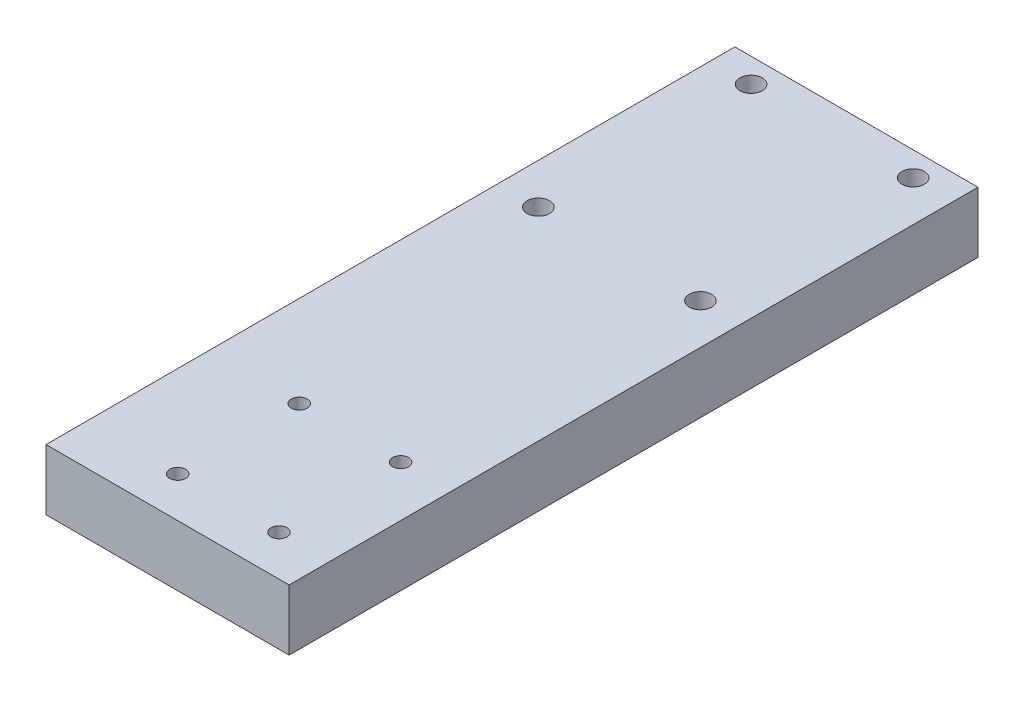
ISO-10303-21;
HEADER;
FILE_DESCRIPTION(('STEP AP214'),'2;1');
FILE_NAME('part.step','',(''),(''),'','','');
FILE_SCHEMA(('AUTOMOTIVE_DESIGN { 1 0 10303 214 1 1 1 1 }'));
ENDSEC;
DATA;
#1=APPLICATION_CONTEXT('core data for automotive mechanical design processes');
#2=APPLICATION_PROTOCOL_DEFINITION('international standard','automotive_design',2000,#1);
#3=PRODUCT_CONTEXT('',#1,'mechanical');
#4=PRODUCT('Part','Part','',(#3));
#5=PRODUCT_RELATED_PRODUCT_CATEGORY('part','',(#4));
#6=PRODUCT_DEFINITION_FORMATION('','',#4);
#7=PRODUCT_DEFINITION_CONTEXT('part definition',#1,'design');
#8=PRODUCT_DEFINITION('design','',#6,#7);
#9=PRODUCT_DEFINITION_SHAPE('','',#8);
#10=(LENGTH_UNIT() NAMED_UNIT(*) SI_UNIT(.MILLI.,.METRE.));
#11=(NAMED_UNIT(*) PLANE_ANGLE_UNIT() SI_UNIT($,.RADIAN.));
#12=(NAMED_UNIT(*) SI_UNIT($,.STERADIAN.) SOLID_ANGLE_UNIT());
#13=UNCERTAINTY_MEASURE_WITH_UNIT(LENGTH_MEASURE(1.E-05),#10,'distance_accuracy_value','');
#14=(GEOMETRIC_REPRESENTATION_CONTEXT(3) GLOBAL_UNCERTAINTY_ASSIGNED_CONTEXT((#13)) GLOBAL_UNIT_ASSIGNED_CONTEXT((#10,
#11,#12)) REPRESENTATION_CONTEXT('',''));
#15=CARTESIAN_POINT('',(0.,0.,0.));
#16=DIRECTION('',(0.,0.,1.));
#17=DIRECTION('',(1.,0.,0.));
#18=AXIS2_PLACEMENT_3D('',#15,#16,#17);
#19=CARTESIAN_POINT('',(0.,0.,215.9));
#20=DIRECTION('',(1.,0.,0.));
#21=DIRECTION('',(0.,0.,-1.));
#22=AXIS2_PLACEMENT_3D('',#19,#20,#21);
#23=PLANE('',#22);
#24=DIRECTION('',(0.,-1.,0.));
#25=VECTOR('',#24,1.);
#26=CARTESIAN_POINT('',(0.,0.,0.));
#27=LINE('',#26,#25);
#28=CARTESIAN_POINT('',(0.,19.05,0.));
#29=VERTEX_POINT('',#28);
#30=CARTESIAN_POINT('',(0.,0.,0.));
#31=VERTEX_POINT('',#30);
#32=EDGE_CURVE('E106',#29,#31,#27,.T.);
#33=ORIENTED_EDGE('',*,*,#32,.T.);
#34=DIRECTION('',(0.,0.,-1.));
#35=VECTOR('',#34,1.);
#36=CARTESIAN_POINT('',(0.,0.,215.9));
#37=LINE('',#36,#35);
#38=CARTESIAN_POINT('',(0.,0.,215.9));
#39=VERTEX_POINT('',#38);
#40=EDGE_CURVE('E11',#39,#31,#37,.T.);
#41=ORIENTED_EDGE('',*,*,#40,.F.);
#42=DIRECTION('',(0.,-1.,0.));
#43=VECTOR('',#42,1.);
#44=CARTESIAN_POINT('',(0.,0.,215.9));
#45=LINE('',#44,#43);
#46=CARTESIAN_POINT('',(0.,19.05,215.9));
#47=VERTEX_POINT('',#46);
#48=EDGE_CURVE('E90',#47,#39,#45,.T.);
#49=ORIENTED_EDGE('',*,*,#48,.F.);
#50=DIRECTION('',(0.,0.,-1.));
#51=VECTOR('',#50,1.);
#52=CARTESIAN_POINT('',(0.,19.05,215.9));
#53=LINE('',#52,#51);
#54=EDGE_CURVE('E102',#47,#29,#53,.T.);
#55=ORIENTED_EDGE('',*,*,#54,.T.);
#56=EDGE_LOOP('',(#33,#41,#49,#55));
#57=FACE_BOUND('',#56,.T.);
#58=ADVANCED_FACE('F38',(#57),#23,.F.);
#59=CARTESIAN_POINT('',(0.,0.,215.9));
#60=DIRECTION('',(0.,1.,0.));
#61=DIRECTION('',(0.,0.,1.));
#62=AXIS2_PLACEMENT_3D('',#59,#60,#61);
#63=PLANE('',#62);
#64=CARTESIAN_POINT('',(28.5749999999999,0.,165.1));
#65=DIRECTION('',(0.,1.,0.));
#66=DIRECTION('',(0.,0.,1.));
#67=AXIS2_PLACEMENT_3D('',#64,#65,#66);
#68=CIRCLE('',#67,2.5);
#69=CARTESIAN_POINT('',(28.5749999999999,0.,167.6));
#70=VERTEX_POINT('',#69);
#71=EDGE_CURVE('E171',#70,#70,#68,.T.);
#72=ORIENTED_EDGE('',*,*,#71,.T.);
#73=EDGE_LOOP('',(#72));
#74=FACE_BOUND('',#73,.T.);
#75=CARTESIAN_POINT('',(60.3249999999999,0.,165.1));
#76=DIRECTION('',(0.,1.,0.));
#77=DIRECTION('',(0.,0.,1.));
#78=AXIS2_PLACEMENT_3D('',#75,#76,#77);
#79=CIRCLE('',#78,2.50000000000001);
#80=CARTESIAN_POINT('',(60.3249999999999,0.,167.6));
#81=VERTEX_POINT('',#80);
#82=EDGE_CURVE('E179',#81,#81,#79,.T.);
#83=ORIENTED_EDGE('',*,*,#82,.T.);
#84=EDGE_LOOP('',(#83));
#85=FACE_BOUND('',#84,.T.);
#86=CARTESIAN_POINT('',(60.325,0.,203.2));
#87=DIRECTION('',(0.,1.,0.));
#88=DIRECTION('',(0.,0.,1.));
#89=AXIS2_PLACEMENT_3D('',#86,#87,#88);
#90=CIRCLE('',#89,2.5);
#91=CARTESIAN_POINT('',(60.325,0.,205.7));
#92=VERTEX_POINT('',#91);
#93=EDGE_CURVE('E163',#92,#92,#90,.T.);
#94=ORIENTED_EDGE('',*,*,#93,.T.);
#95=EDGE_LOOP('',(#94));
#96=FACE_BOUND('',#95,.T.);
#97=CARTESIAN_POINT('',(28.575,0.,203.2));
#98=DIRECTION('',(0.,1.,0.));
#99=DIRECTION('',(0.,0.,1.));
#100=AXIS2_PLACEMENT_3D('',#97,#98,#99);
#101=CIRCLE('',#100,2.5);
#102=CARTESIAN_POINT('',(28.575,0.,205.7));
#103=VERTEX_POINT('',#102);
#104=EDGE_CURVE('E140',#103,#103,#101,.T.);
#105=ORIENTED_EDGE('',*,*,#104,.T.);
#106=EDGE_LOOP('',(#105));
#107=FACE_BOUND('',#106,.T.);
#108=CARTESIAN_POINT('',(12.7000000000007,0.,74.295));
#109=DIRECTION('',(0.,1.,0.));
#110=DIRECTION('',(0.,0.,1.));
#111=AXIS2_PLACEMENT_3D('',#108,#109,#110);
#112=CIRCLE('',#111,3.5);
#113=CARTESIAN_POINT('',(12.7000000000007,0.,77.795));
#114=VERTEX_POINT('',#113);
#115=EDGE_CURVE('E139',#114,#114,#112,.T.);
#116=ORIENTED_EDGE('',*,*,#115,.T.);
#117=EDGE_LOOP('',(#116));
#118=FACE_BOUND('',#117,.T.);
#119=CARTESIAN_POINT('',(63.5000000000007,0.,74.295));
#120=DIRECTION('',(0.,1.,0.));
#121=DIRECTION('',(0.,0.,1.));
#122=AXIS2_PLACEMENT_3D('',#119,#120,#121);
#123=CIRCLE('',#122,3.50000000000001);
#124=CARTESIAN_POINT('',(63.5000000000007,0.,77.795));
#125=VERTEX_POINT('',#124);
#126=EDGE_CURVE('E148',#125,#125,#123,.T.);
#127=ORIENTED_EDGE('',*,*,#126,.T.);
#128=EDGE_LOOP('',(#127));
#129=FACE_BOUND('',#128,.T.);
#130=CARTESIAN_POINT('',(63.5,0.,7.61999999999999));
#131=DIRECTION('',(0.,1.,0.));
#132=DIRECTION('',(0.,0.,1.));
#133=AXIS2_PLACEMENT_3D('',#130,#131,#132);
#134=CIRCLE('',#133,3.49999999999999);
#135=CARTESIAN_POINT('',(63.5,0.,11.12));
#136=VERTEX_POINT('',#135);
#137=EDGE_CURVE('E131',#136,#136,#134,.T.);
#138=ORIENTED_EDGE('',*,*,#137,.T.);
#139=EDGE_LOOP('',(#138));
#140=FACE_BOUND('',#139,.T.);
#141=CARTESIAN_POINT('',(12.7,0.,7.61999999999999));
#142=DIRECTION('',(0.,1.,0.));
#143=DIRECTION('',(0.,0.,1.));
#144=AXIS2_PLACEMENT_3D('',#141,#142,#143);
#145=CIRCLE('',#144,3.5);
#146=CARTESIAN_POINT('',(12.7,0.,11.12));
#147=VERTEX_POINT('',#146);
#148=EDGE_CURVE('E110',#147,#147,#145,.T.);
#149=ORIENTED_EDGE('',*,*,#148,.T.);
#150=EDGE_LOOP('',(#149));
#151=FACE_BOUND('',#150,.T.);
#152=DIRECTION('',(1.,0.,0.));
#153=VECTOR('',#152,1.);
#154=CARTESIAN_POINT('',(0.,0.,0.));
#155=LINE('',#154,#153);
#156=CARTESIAN_POINT('',(76.2,0.,0.));
#157=VERTEX_POINT('',#156);
#158=EDGE_CURVE('E95',#31,#157,#155,.T.);
#159=ORIENTED_EDGE('',*,*,#158,.T.);
#160=DIRECTION('',(0.,0.,-1.));
#161=VECTOR('',#160,1.);
#162=CARTESIAN_POINT('',(76.2,0.,215.9));
#163=LINE('',#162,#161);
#164=CARTESIAN_POINT('',(76.2,0.,215.9));
#165=VERTEX_POINT('',#164);
#166=EDGE_CURVE('E47',#165,#157,#163,.T.);
#167=ORIENTED_EDGE('',*,*,#166,.F.);
#168=DIRECTION('',(1.,0.,0.));
#169=VECTOR('',#168,1.);
#170=CARTESIAN_POINT('',(0.,0.,215.9));
#171=LINE('',#170,#169);
#172=EDGE_CURVE('E85',#39,#165,#171,.T.);
#173=ORIENTED_EDGE('',*,*,#172,.F.);
#174=ORIENTED_EDGE('',*,*,#40,.T.);
#175=EDGE_LOOP('',(#159,#167,#173,#174));
#176=FACE_BOUND('',#175,.T.);
#177=ADVANCED_FACE('F94',(#74,#85,#96,#107,#118,#129,#140,#151,#176),#63,.F.);
#178=CARTESIAN_POINT('',(76.2,0.,215.9));
#179=DIRECTION('',(-1.,0.,0.));
#180=DIRECTION('',(0.,0.,1.));
#181=AXIS2_PLACEMENT_3D('',#178,#179,#180);
#182=PLANE('',#181);
#183=DIRECTION('',(0.,1.,0.));
#184=VECTOR('',#183,1.);
#185=CARTESIAN_POINT('',(76.2,0.,0.));
#186=LINE('',#185,#184);
#187=CARTESIAN_POINT('',(76.2,19.05,0.));
#188=VERTEX_POINT('',#187);
#189=EDGE_CURVE('E72',#157,#188,#186,.T.);
#190=ORIENTED_EDGE('',*,*,#189,.T.);
#191=DIRECTION('',(0.,0.,-1.));
#192=VECTOR('',#191,1.);
#193=CARTESIAN_POINT('',(76.2,19.05,215.9));
#194=LINE('',#193,#192);
#195=CARTESIAN_POINT('',(76.2,19.05,215.9));
#196=VERTEX_POINT('',#195);
#197=EDGE_CURVE('E97',#196,#188,#194,.T.);
#198=ORIENTED_EDGE('',*,*,#197,.F.);
#199=DIRECTION('',(0.,1.,0.));
#200=VECTOR('',#199,1.);
#201=CARTESIAN_POINT('',(76.2,0.,215.9));
#202=LINE('',#201,#200);
#203=EDGE_CURVE('E88',#165,#196,#202,.T.);
#204=ORIENTED_EDGE('',*,*,#203,.F.);
#205=ORIENTED_EDGE('',*,*,#166,.T.);
#206=EDGE_LOOP('',(#190,#198,#204,#205));
#207=FACE_BOUND('',#206,.T.);
#208=ADVANCED_FACE('F98',(#207),#182,.F.);
#209=CARTESIAN_POINT('',(0.,19.05,215.9));
#210=DIRECTION('',(0.,-1.,0.));
#211=DIRECTION('',(0.,0.,-1.));
#212=AXIS2_PLACEMENT_3D('',#209,#210,#211);
#213=PLANE('',#212);
#214=CARTESIAN_POINT('',(28.5749999999999,19.05,165.1));
#215=DIRECTION('',(0.,1.,0.));
#216=DIRECTION('',(0.,0.,1.));
#217=AXIS2_PLACEMENT_3D('',#214,#215,#216);
#218=CIRCLE('',#217,2.5);
#219=CARTESIAN_POINT('',(28.5749999999999,19.05,167.6));
#220=VERTEX_POINT('',#219);
#221=EDGE_CURVE('E167',#220,#220,#218,.T.);
#222=ORIENTED_EDGE('',*,*,#221,.F.);
#223=EDGE_LOOP('',(#222));
#224=FACE_BOUND('',#223,.T.);
#225=CARTESIAN_POINT('',(60.3249999999999,19.05,165.1));
#226=DIRECTION('',(0.,1.,0.));
#227=DIRECTION('',(0.,0.,1.));
#228=AXIS2_PLACEMENT_3D('',#225,#226,#227);
#229=CIRCLE('',#228,2.50000000000001);
#230=CARTESIAN_POINT('',(60.3249999999999,19.05,167.6));
#231=VERTEX_POINT('',#230);
#232=EDGE_CURVE('E175',#231,#231,#229,.T.);
#233=ORIENTED_EDGE('',*,*,#232,.F.);
#234=EDGE_LOOP('',(#233));
#235=FACE_BOUND('',#234,.T.);
#236=CARTESIAN_POINT('',(60.325,19.05,203.2));
#237=DIRECTION('',(0.,1.,0.));
#238=DIRECTION('',(0.,0.,1.));
#239=AXIS2_PLACEMENT_3D('',#236,#237,#238);
#240=CIRCLE('',#239,2.5);
#241=CARTESIAN_POINT('',(60.325,19.05,205.7));
#242=VERTEX_POINT('',#241);
#243=EDGE_CURVE('E183',#242,#242,#240,.T.);
#244=ORIENTED_EDGE('',*,*,#243,.F.);
#245=EDGE_LOOP('',(#244));
#246=FACE_BOUND('',#245,.T.);
#247=CARTESIAN_POINT('',(28.575,19.05,203.2));
#248=DIRECTION('',(0.,1.,0.));
#249=DIRECTION('',(0.,0.,1.));
#250=AXIS2_PLACEMENT_3D('',#247,#248,#249);
#251=CIRCLE('',#250,2.5);
#252=CARTESIAN_POINT('',(28.575,19.05,205.7));
#253=VERTEX_POINT('',#252);
#254=EDGE_CURVE('E159',#253,#253,#251,.T.);
#255=ORIENTED_EDGE('',*,*,#254,.F.);
#256=EDGE_LOOP('',(#255));
#257=FACE_BOUND('',#256,.T.);
#258=CARTESIAN_POINT('',(12.7000000000007,19.05,74.295));
#259=DIRECTION('',(0.,1.,0.));
#260=DIRECTION('',(0.,0.,1.));
#261=AXIS2_PLACEMENT_3D('',#258,#259,#260);
#262=CIRCLE('',#261,3.5);
#263=CARTESIAN_POINT('',(12.7000000000007,19.05,77.795));
#264=VERTEX_POINT('',#263);
#265=EDGE_CURVE('E135',#264,#264,#262,.T.);
#266=ORIENTED_EDGE('',*,*,#265,.F.);
#267=EDGE_LOOP('',(#266));
#268=FACE_BOUND('',#267,.T.);
#269=CARTESIAN_POINT('',(63.5000000000007,19.05,74.295));
#270=DIRECTION('',(0.,1.,0.));
#271=DIRECTION('',(0.,0.,1.));
#272=AXIS2_PLACEMENT_3D('',#269,#270,#271);
#273=CIRCLE('',#272,3.50000000000001);
#274=CARTESIAN_POINT('',(63.5000000000007,19.05,77.795));
#275=VERTEX_POINT('',#274);
#276=EDGE_CURVE('E144',#275,#275,#273,.T.);
#277=ORIENTED_EDGE('',*,*,#276,.F.);
#278=EDGE_LOOP('',(#277));
#279=FACE_BOUND('',#278,.T.);
#280=CARTESIAN_POINT('',(63.5,19.05,7.61999999999999));
#281=DIRECTION('',(0.,1.,0.));
#282=DIRECTION('',(0.,0.,1.));
#283=AXIS2_PLACEMENT_3D('',#280,#281,#282);
#284=CIRCLE('',#283,3.49999999999999);
#285=CARTESIAN_POINT('',(63.5,19.05,11.12));
#286=VERTEX_POINT('',#285);
#287=EDGE_CURVE('E152',#286,#286,#284,.T.);
#288=ORIENTED_EDGE('',*,*,#287,.F.);
#289=EDGE_LOOP('',(#288));
#290=FACE_BOUND('',#289,.T.);
#291=CARTESIAN_POINT('',(12.7,19.05,7.61999999999999));
#292=DIRECTION('',(0.,1.,0.));
#293=DIRECTION('',(0.,0.,1.));
#294=AXIS2_PLACEMENT_3D('',#291,#292,#293);
#295=CIRCLE('',#294,3.5);
#296=CARTESIAN_POINT('',(12.7,19.05,11.12));
#297=VERTEX_POINT('',#296);
#298=EDGE_CURVE('E127',#297,#297,#295,.T.);
#299=ORIENTED_EDGE('',*,*,#298,.F.);
#300=EDGE_LOOP('',(#299));
#301=FACE_BOUND('',#300,.T.);
#302=DIRECTION('',(-1.,0.,0.));
#303=VECTOR('',#302,1.);
#304=CARTESIAN_POINT('',(0.,19.05,0.));
#305=LINE('',#304,#303);
#306=EDGE_CURVE('E78',#188,#29,#305,.T.);
#307=ORIENTED_EDGE('',*,*,#306,.T.);
#308=ORIENTED_EDGE('',*,*,#54,.F.);
#309=DIRECTION('',(-1.,0.,0.));
#310=VECTOR('',#309,1.);
#311=CARTESIAN_POINT('',(0.,19.05,215.9));
#312=LINE('',#311,#310);
#313=EDGE_CURVE('E55',#196,#47,#312,.T.);
#314=ORIENTED_EDGE('',*,*,#313,.F.);
#315=ORIENTED_EDGE('',*,*,#197,.T.);
#316=EDGE_LOOP('',(#307,#308,#314,#315));
#317=FACE_BOUND('',#316,.T.);
#318=ADVANCED_FACE('F120',(#224,#235,#246,#257,#268,#279,#290,#301,#317),#213,.F.);
#319=CARTESIAN_POINT('',(0.,0.,215.9));
#320=DIRECTION('',(0.,0.,-1.));
#321=DIRECTION('',(-1.,0.,0.));
#322=AXIS2_PLACEMENT_3D('',#319,#320,#321);
#323=PLANE('',#322);
#324=ORIENTED_EDGE('',*,*,#48,.T.);
#325=ORIENTED_EDGE('',*,*,#172,.T.);
#326=ORIENTED_EDGE('',*,*,#203,.T.);
#327=ORIENTED_EDGE('',*,*,#313,.T.);
#328=EDGE_LOOP('',(#324,#325,#326,#327));
#329=FACE_BOUND('',#328,.T.);
#330=ADVANCED_FACE('F86',(#329),#323,.F.);
#331=CARTESIAN_POINT('',(0.,0.,0.));
#332=DIRECTION('',(0.,0.,-1.));
#333=DIRECTION('',(-1.,0.,0.));
#334=AXIS2_PLACEMENT_3D('',#331,#332,#333);
#335=PLANE('',#334);
#336=ORIENTED_EDGE('',*,*,#32,.F.);
#337=ORIENTED_EDGE('',*,*,#306,.F.);
#338=ORIENTED_EDGE('',*,*,#189,.F.);
#339=ORIENTED_EDGE('',*,*,#158,.F.);
#340=EDGE_LOOP('',(#336,#337,#338,#339));
#341=FACE_BOUND('',#340,.T.);
#342=ADVANCED_FACE('F123',(#341),#335,.T.);
#343=CARTESIAN_POINT('',(12.7,0.,7.61999999999999));
#344=DIRECTION('',(0.,1.,0.));
#345=DIRECTION('',(0.,0.,1.));
#346=AXIS2_PLACEMENT_3D('',#343,#344,#345);
#347=CYLINDRICAL_SURFACE('',#346,3.5);
#348=ORIENTED_EDGE('',*,*,#148,.F.);
#349=EDGE_LOOP('',(#348));
#350=FACE_BOUND('',#349,.T.);
#351=ORIENTED_EDGE('',*,*,#298,.T.);
#352=EDGE_LOOP('',(#351));
#353=FACE_BOUND('',#352,.T.);
#354=ADVANCED_FACE('F215',(#350,#353),#347,.F.);
#355=CARTESIAN_POINT('',(63.5,0.,7.61999999999999));
#356=DIRECTION('',(0.,1.,0.));
#357=DIRECTION('',(0.,0.,1.));
#358=AXIS2_PLACEMENT_3D('',#355,#356,#357);
#359=CYLINDRICAL_SURFACE('',#358,3.49999999999999);
#360=ORIENTED_EDGE('',*,*,#137,.F.);
#361=EDGE_LOOP('',(#360));
#362=FACE_BOUND('',#361,.T.);
#363=ORIENTED_EDGE('',*,*,#287,.T.);
#364=EDGE_LOOP('',(#363));
#365=FACE_BOUND('',#364,.T.);
#366=ADVANCED_FACE('F217',(#362,#365),#359,.F.);
#367=CARTESIAN_POINT('',(63.5000000000007,0.,74.295));
#368=DIRECTION('',(0.,1.,0.));
#369=DIRECTION('',(0.,0.,1.));
#370=AXIS2_PLACEMENT_3D('',#367,#368,#369);
#371=CYLINDRICAL_SURFACE('',#370,3.50000000000001);
#372=ORIENTED_EDGE('',*,*,#126,.F.);
#373=EDGE_LOOP('',(#372));
#374=FACE_BOUND('',#373,.T.);
#375=ORIENTED_EDGE('',*,*,#276,.T.);
#376=EDGE_LOOP('',(#375));
#377=FACE_BOUND('',#376,.T.);
#378=ADVANCED_FACE('F224',(#374,#377),#371,.F.);
#379=CARTESIAN_POINT('',(12.7000000000007,0.,74.295));
#380=DIRECTION('',(0.,1.,0.));
#381=DIRECTION('',(0.,0.,1.));
#382=AXIS2_PLACEMENT_3D('',#379,#380,#381);
#383=CYLINDRICAL_SURFACE('',#382,3.5);
#384=ORIENTED_EDGE('',*,*,#115,.F.);
#385=EDGE_LOOP('',(#384));
#386=FACE_BOUND('',#385,.T.);
#387=ORIENTED_EDGE('',*,*,#265,.T.);
#388=EDGE_LOOP('',(#387));
#389=FACE_BOUND('',#388,.T.);
#390=ADVANCED_FACE('F271',(#386,#389),#383,.F.);
#391=CARTESIAN_POINT('',(28.575,0.,203.2));
#392=DIRECTION('',(0.,1.,0.));
#393=DIRECTION('',(0.,0.,1.));
#394=AXIS2_PLACEMENT_3D('',#391,#392,#393);
#395=CYLINDRICAL_SURFACE('',#394,2.5);
#396=ORIENTED_EDGE('',*,*,#104,.F.);
#397=EDGE_LOOP('',(#396));
#398=FACE_BOUND('',#397,.T.);
#399=ORIENTED_EDGE('',*,*,#254,.T.);
#400=EDGE_LOOP('',(#399));
#401=FACE_BOUND('',#400,.T.);
#402=ADVANCED_FACE('F197',(#398,#401),#395,.F.);
#403=CARTESIAN_POINT('',(60.325,0.,203.2));
#404=DIRECTION('',(0.,1.,0.));
#405=DIRECTION('',(0.,0.,1.));
#406=AXIS2_PLACEMENT_3D('',#403,#404,#405);
#407=CYLINDRICAL_SURFACE('',#406,2.5);
#408=ORIENTED_EDGE('',*,*,#93,.F.);
#409=EDGE_LOOP('',(#408));
#410=FACE_BOUND('',#409,.T.);
#411=ORIENTED_EDGE('',*,*,#243,.T.);
#412=EDGE_LOOP('',(#411));
#413=FACE_BOUND('',#412,.T.);
#414=ADVANCED_FACE('F193',(#410,#413),#407,.F.);
#415=CARTESIAN_POINT('',(60.3249999999999,0.,165.1));
#416=DIRECTION('',(0.,1.,0.));
#417=DIRECTION('',(0.,0.,1.));
#418=AXIS2_PLACEMENT_3D('',#415,#416,#417);
#419=CYLINDRICAL_SURFACE('',#418,2.50000000000001);
#420=ORIENTED_EDGE('',*,*,#82,.F.);
#421=EDGE_LOOP('',(#420));
#422=FACE_BOUND('',#421,.T.);
#423=ORIENTED_EDGE('',*,*,#232,.T.);
#424=EDGE_LOOP('',(#423));
#425=FACE_BOUND('',#424,.T.);
#426=ADVANCED_FACE('F196',(#422,#425),#419,.F.);
#427=CARTESIAN_POINT('',(28.5749999999999,0.,165.1));
#428=DIRECTION('',(0.,1.,0.));
#429=DIRECTION('',(0.,0.,1.));
#430=AXIS2_PLACEMENT_3D('',#427,#428,#429);
#431=CYLINDRICAL_SURFACE('',#430,2.5);
#432=ORIENTED_EDGE('',*,*,#71,.F.);
#433=EDGE_LOOP('',(#432));
#434=FACE_BOUND('',#433,.T.);
#435=ORIENTED_EDGE('',*,*,#221,.T.);
#436=EDGE_LOOP('',(#435));
#437=FACE_BOUND('',#436,.T.);
#438=ADVANCED_FACE('F299',(#434,#437),#431,.F.);
#439=CLOSED_SHELL('',(#58,#177,#208,#318,#330,#342,#354,#366,#378,#390,#402,#414,#426,#438));
#440=MANIFOLD_SOLID_BREP('B2',#439);
#441=ADVANCED_BREP_SHAPE_REPRESENTATION('',(#18,#440),#14);
#442=SHAPE_DEFINITION_REPRESENTATION(#9,#441);
ENDSEC;
END-ISO-10303-21;
